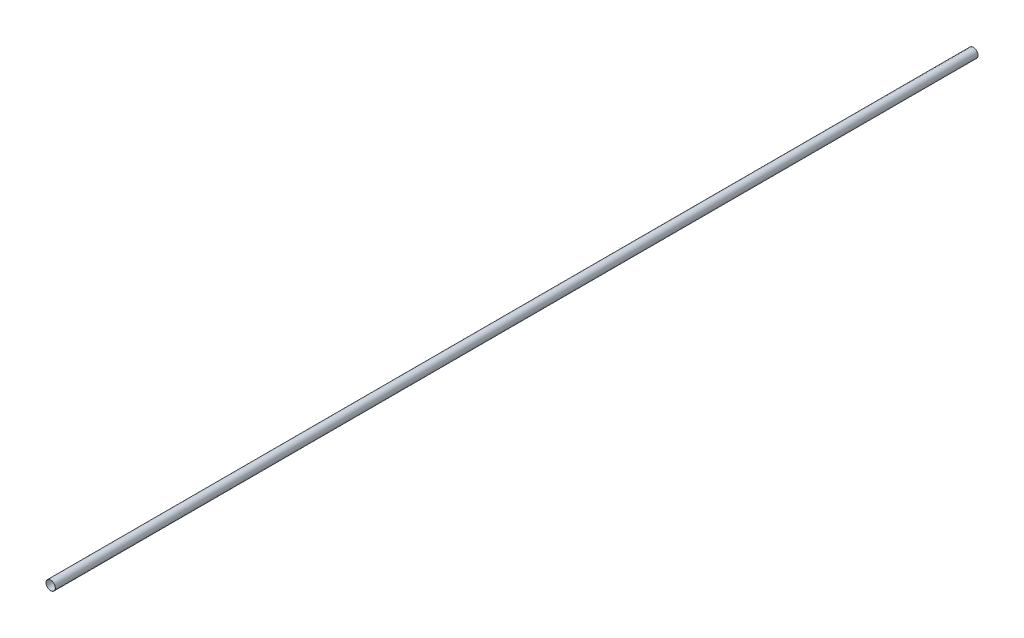
ISO-10303-21;
HEADER;
FILE_DESCRIPTION(('STEP AP214'),'2;1');
FILE_NAME('part.step','',(''),(''),'','','');
FILE_SCHEMA(('AUTOMOTIVE_DESIGN { 1 0 10303 214 1 1 1 1 }'));
ENDSEC;
DATA;
#1=APPLICATION_CONTEXT('core data for automotive mechanical design processes');
#2=APPLICATION_PROTOCOL_DEFINITION('international standard','automotive_design',2000,#1);
#3=PRODUCT_CONTEXT('',#1,'mechanical');
#4=PRODUCT('Part','Part','',(#3));
#5=PRODUCT_RELATED_PRODUCT_CATEGORY('part','',(#4));
#6=PRODUCT_DEFINITION_FORMATION('','',#4);
#7=PRODUCT_DEFINITION_CONTEXT('part definition',#1,'design');
#8=PRODUCT_DEFINITION('design','',#6,#7);
#9=PRODUCT_DEFINITION_SHAPE('','',#8);
#10=(LENGTH_UNIT() NAMED_UNIT(*) SI_UNIT(.MILLI.,.METRE.));
#11=(NAMED_UNIT(*) PLANE_ANGLE_UNIT() SI_UNIT($,.RADIAN.));
#12=(NAMED_UNIT(*) SI_UNIT($,.STERADIAN.) SOLID_ANGLE_UNIT());
#13=UNCERTAINTY_MEASURE_WITH_UNIT(LENGTH_MEASURE(1.E-05),#10,'distance_accuracy_value','');
#14=(GEOMETRIC_REPRESENTATION_CONTEXT(3) GLOBAL_UNCERTAINTY_ASSIGNED_CONTEXT((#13)) GLOBAL_UNIT_ASSIGNED_CONTEXT((#10,
#11,#12)) REPRESENTATION_CONTEXT('',''));
#15=CARTESIAN_POINT('',(0.,0.,0.));
#16=DIRECTION('',(0.,0.,1.));
#17=DIRECTION('',(1.,0.,0.));
#18=AXIS2_PLACEMENT_3D('',#15,#16,#17);
#19=CARTESIAN_POINT('',(0.,0.,20000.));
#20=DIRECTION('',(0.,0.,1.));
#21=DIRECTION('',(1.,0.,0.));
#22=AXIS2_PLACEMENT_3D('',#19,#20,#21);
#23=PLANE('',#22);
#24=CARTESIAN_POINT('',(0.,0.,20000.));
#25=DIRECTION('',(0.,0.,1.));
#26=DIRECTION('',(1.,0.,0.));
#27=AXIS2_PLACEMENT_3D('',#24,#25,#26);
#28=CIRCLE('',#27,101.);
#29=CARTESIAN_POINT('',(101.,0.,20000.));
#30=VERTEX_POINT('',#29);
#31=EDGE_CURVE('E10',#30,#30,#28,.T.);
#32=ORIENTED_EDGE('',*,*,#31,.T.);
#33=EDGE_LOOP('',(#32));
#34=FACE_BOUND('',#33,.T.);
#35=CARTESIAN_POINT('',(0.,0.,20000.));
#36=DIRECTION('',(0.,0.,1.));
#37=DIRECTION('',(1.,0.,0.));
#38=AXIS2_PLACEMENT_3D('',#35,#36,#37);
#39=CIRCLE('',#38,100.);
#40=CARTESIAN_POINT('',(100.,0.,20000.));
#41=VERTEX_POINT('',#40);
#42=EDGE_CURVE('E52',#41,#41,#39,.T.);
#43=ORIENTED_EDGE('',*,*,#42,.F.);
#44=EDGE_LOOP('',(#43));
#45=FACE_BOUND('',#44,.T.);
#46=ADVANCED_FACE('F41',(#34,#45),#23,.T.);
#47=CARTESIAN_POINT('',(0.,0.,0.));
#48=DIRECTION('',(0.,0.,1.));
#49=DIRECTION('',(1.,0.,0.));
#50=AXIS2_PLACEMENT_3D('',#47,#48,#49);
#51=PLANE('',#50);
#52=CARTESIAN_POINT('',(0.,0.,0.));
#53=DIRECTION('',(0.,0.,1.));
#54=DIRECTION('',(1.,0.,0.));
#55=AXIS2_PLACEMENT_3D('',#52,#53,#54);
#56=CIRCLE('',#55,101.);
#57=CARTESIAN_POINT('',(101.,0.,0.));
#58=VERTEX_POINT('',#57);
#59=EDGE_CURVE('E45',#58,#58,#56,.T.);
#60=ORIENTED_EDGE('',*,*,#59,.F.);
#61=EDGE_LOOP('',(#60));
#62=FACE_BOUND('',#61,.T.);
#63=CARTESIAN_POINT('',(0.,0.,0.));
#64=DIRECTION('',(0.,0.,1.));
#65=DIRECTION('',(1.,0.,0.));
#66=AXIS2_PLACEMENT_3D('',#63,#64,#65);
#67=CIRCLE('',#66,100.);
#68=CARTESIAN_POINT('',(100.,0.,0.));
#69=VERTEX_POINT('',#68);
#70=EDGE_CURVE('E54',#69,#69,#67,.T.);
#71=ORIENTED_EDGE('',*,*,#70,.T.);
#72=EDGE_LOOP('',(#71));
#73=FACE_BOUND('',#72,.T.);
#74=ADVANCED_FACE('F64',(#62,#73),#51,.F.);
#75=CARTESIAN_POINT('',(0.,0.,20000.));
#76=DIRECTION('',(0.,0.,-1.));
#77=DIRECTION('',(-1.,0.,0.));
#78=AXIS2_PLACEMENT_3D('',#75,#76,#77);
#79=CYLINDRICAL_SURFACE('',#78,101.);
#80=ORIENTED_EDGE('',*,*,#31,.F.);
#81=EDGE_LOOP('',(#80));
#82=FACE_BOUND('',#81,.T.);
#83=ORIENTED_EDGE('',*,*,#59,.T.);
#84=EDGE_LOOP('',(#83));
#85=FACE_BOUND('',#84,.T.);
#86=ADVANCED_FACE('F43',(#82,#85),#79,.T.);
#87=CARTESIAN_POINT('',(0.,0.,20000.));
#88=DIRECTION('',(0.,0.,-1.));
#89=DIRECTION('',(-1.,0.,0.));
#90=AXIS2_PLACEMENT_3D('',#87,#88,#89);
#91=CYLINDRICAL_SURFACE('',#90,100.);
#92=ORIENTED_EDGE('',*,*,#42,.T.);
#93=EDGE_LOOP('',(#92));
#94=FACE_BOUND('',#93,.T.);
#95=ORIENTED_EDGE('',*,*,#70,.F.);
#96=EDGE_LOOP('',(#95));
#97=FACE_BOUND('',#96,.T.);
#98=ADVANCED_FACE('F60',(#94,#97),#91,.F.);
#99=CLOSED_SHELL('',(#46,#74,#86,#98));
#100=MANIFOLD_SOLID_BREP('B2',#99);
#101=ADVANCED_BREP_SHAPE_REPRESENTATION('',(#18,#100),#14);
#102=SHAPE_DEFINITION_REPRESENTATION(#9,#101);
ENDSEC;
END-ISO-10303-21;
